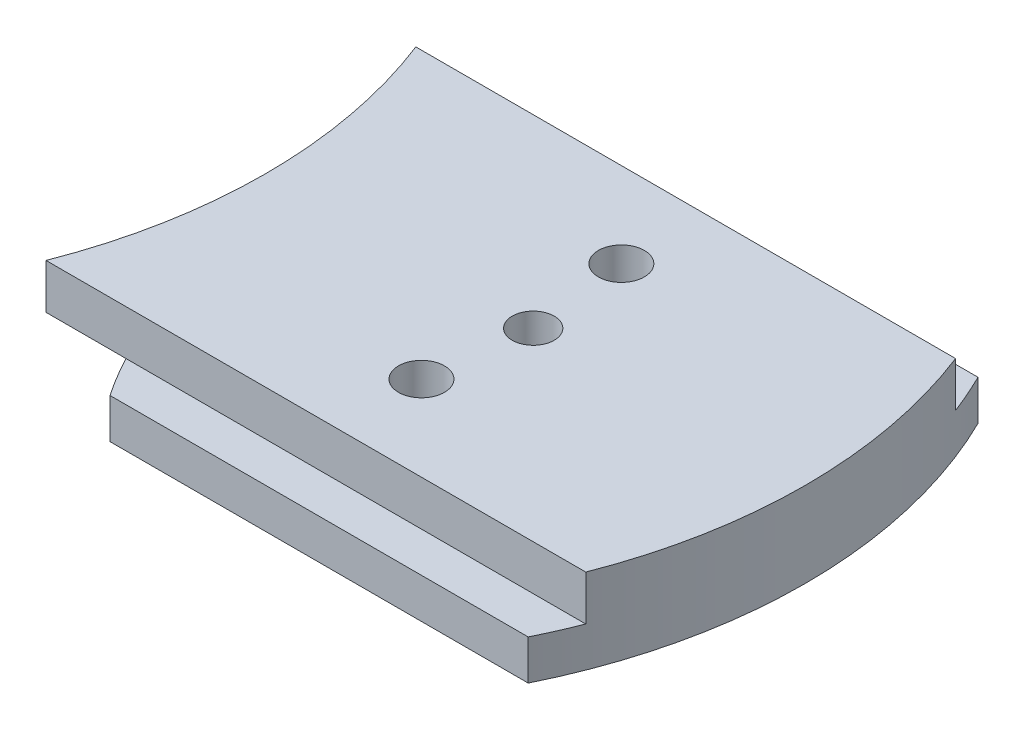
ISO-10303-21;
HEADER;
FILE_DESCRIPTION(('STEP AP214'),'2;1');
FILE_NAME('part.step','',(''),(''),'','','');
FILE_SCHEMA(('AUTOMOTIVE_DESIGN { 1 0 10303 214 1 1 1 1 }'));
ENDSEC;
DATA;
#1=APPLICATION_CONTEXT('core data for automotive mechanical design processes');
#2=APPLICATION_PROTOCOL_DEFINITION('international standard','automotive_design',2000,#1);
#3=PRODUCT_CONTEXT('',#1,'mechanical');
#4=PRODUCT('Part','Part','',(#3));
#5=PRODUCT_RELATED_PRODUCT_CATEGORY('part','',(#4));
#6=PRODUCT_DEFINITION_FORMATION('','',#4);
#7=PRODUCT_DEFINITION_CONTEXT('part definition',#1,'design');
#8=PRODUCT_DEFINITION('design','',#6,#7);
#9=PRODUCT_DEFINITION_SHAPE('','',#8);
#10=(LENGTH_UNIT() NAMED_UNIT(*) SI_UNIT(.MILLI.,.METRE.));
#11=(NAMED_UNIT(*) PLANE_ANGLE_UNIT() SI_UNIT($,.RADIAN.));
#12=(NAMED_UNIT(*) SI_UNIT($,.STERADIAN.) SOLID_ANGLE_UNIT());
#13=UNCERTAINTY_MEASURE_WITH_UNIT(LENGTH_MEASURE(1.E-05),#10,'distance_accuracy_value','');
#14=(GEOMETRIC_REPRESENTATION_CONTEXT(3) GLOBAL_UNCERTAINTY_ASSIGNED_CONTEXT((#13)) GLOBAL_UNIT_ASSIGNED_CONTEXT((#10,
#11,#12)) REPRESENTATION_CONTEXT('',''));
#15=CARTESIAN_POINT('',(0.,0.,0.));
#16=DIRECTION('',(0.,0.,1.));
#17=DIRECTION('',(1.,0.,0.));
#18=AXIS2_PLACEMENT_3D('',#15,#16,#17);
#19=CARTESIAN_POINT('',(0.,2.,0.));
#20=DIRECTION('',(0.,1.,0.));
#21=DIRECTION('',(0.,0.,1.));
#22=AXIS2_PLACEMENT_3D('',#19,#20,#21);
#23=PLANE('',#22);
#24=CARTESIAN_POINT('',(22.6157805464115,2.,-11.25));
#25=DIRECTION('',(0.,1.,0.));
#26=DIRECTION('',(0.,0.,1.));
#27=AXIS2_PLACEMENT_3D('',#24,#25,#26);
#28=CIRCLE('',#27,20.);
#29=CARTESIAN_POINT('',(4.88339492010612,2.,-2.));
#30=VERTEX_POINT('',#29);
#31=CARTESIAN_POINT('',(6.07983485225777,2.,0.));
#32=VERTEX_POINT('',#31);
#33=EDGE_CURVE('E145',#30,#32,#28,.T.);
#34=ORIENTED_EDGE('',*,*,#33,.T.);
#35=DIRECTION('',(1.,0.,0.));
#36=VECTOR('',#35,1.);
#37=CARTESIAN_POINT('',(0.,2.,0.));
#38=LINE('',#37,#36);
#39=CARTESIAN_POINT('',(27.,2.,0.));
#40=VERTEX_POINT('',#39);
#41=EDGE_CURVE('E68',#32,#40,#38,.T.);
#42=ORIENTED_EDGE('',*,*,#41,.T.);
#43=CARTESIAN_POINT('',(4.11578054641147,2.,-11.25));
#44=DIRECTION('',(0.,1.,0.));
#45=DIRECTION('',(0.,0.,1.));
#46=AXIS2_PLACEMENT_3D('',#43,#44,#45);
#47=CIRCLE('',#46,25.5);
#48=CARTESIAN_POINT('',(27.87893479832,2.,-2.));
#49=VERTEX_POINT('',#48);
#50=EDGE_CURVE('E178',#49,#40,#47,.F.);
#51=ORIENTED_EDGE('',*,*,#50,.F.);
#52=DIRECTION('',(-1.,0.,0.));
#53=VECTOR('',#52,1.);
#54=CARTESIAN_POINT('',(0.,2.,-2.));
#55=LINE('',#54,#53);
#56=EDGE_CURVE('E155',#49,#30,#55,.T.);
#57=ORIENTED_EDGE('',*,*,#56,.T.);
#58=EDGE_LOOP('',(#34,#42,#51,#57));
#59=FACE_BOUND('',#58,.T.);
#60=ADVANCED_FACE('F51',(#59),#23,.T.);
#61=CARTESIAN_POINT('',(4.11578054641147,2.,-11.25));
#62=DIRECTION('',(0.,-1.,0.));
#63=DIRECTION('',(0.,0.,-1.));
#64=AXIS2_PLACEMENT_3D('',#61,#62,#63);
#65=CYLINDRICAL_SURFACE('',#64,25.5);
#66=CARTESIAN_POINT('',(4.11578054641147,0.,-11.25));
#67=DIRECTION('',(0.,1.,0.));
#68=DIRECTION('',(0.,0.,1.));
#69=AXIS2_PLACEMENT_3D('',#66,#67,#68);
#70=CIRCLE('',#69,25.5);
#71=CARTESIAN_POINT('',(27.,0.,-22.5));
#72=VERTEX_POINT('',#71);
#73=CARTESIAN_POINT('',(27.,0.,0.));
#74=VERTEX_POINT('',#73);
#75=EDGE_CURVE('E171',#72,#74,#70,.F.);
#76=ORIENTED_EDGE('',*,*,#75,.F.);
#77=DIRECTION('',(0.,-1.,0.));
#78=VECTOR('',#77,1.);
#79=CARTESIAN_POINT('',(27.,2.,-22.5));
#80=LINE('',#79,#78);
#81=CARTESIAN_POINT('',(27.,2.,-22.5));
#82=VERTEX_POINT('',#81);
#83=EDGE_CURVE('E165',#82,#72,#80,.T.);
#84=ORIENTED_EDGE('',*,*,#83,.F.);
#85=CARTESIAN_POINT('',(27.87893479832,2.,-20.5));
#86=VERTEX_POINT('',#85);
#87=EDGE_CURVE('E167',#82,#86,#47,.F.);
#88=ORIENTED_EDGE('',*,*,#87,.T.);
#89=DIRECTION('',(0.,-1.,0.));
#90=VECTOR('',#89,1.);
#91=CARTESIAN_POINT('',(27.87893479832,4.25,-20.5));
#92=LINE('',#91,#90);
#93=CARTESIAN_POINT('',(27.87893479832,4.25,-20.5));
#94=VERTEX_POINT('',#93);
#95=EDGE_CURVE('E239',#94,#86,#92,.T.);
#96=ORIENTED_EDGE('',*,*,#95,.F.);
#97=CARTESIAN_POINT('',(4.11578054641147,4.25,-11.25));
#98=DIRECTION('',(0.,1.,0.));
#99=DIRECTION('',(0.,0.,1.));
#100=AXIS2_PLACEMENT_3D('',#97,#98,#99);
#101=CIRCLE('',#100,25.5);
#102=CARTESIAN_POINT('',(27.87893479832,4.25,-2.));
#103=VERTEX_POINT('',#102);
#104=EDGE_CURVE('E229',#103,#94,#101,.T.);
#105=ORIENTED_EDGE('',*,*,#104,.F.);
#106=DIRECTION('',(0.,-1.,0.));
#107=VECTOR('',#106,1.);
#108=CARTESIAN_POINT('',(27.87893479832,4.25,-2.));
#109=LINE('',#108,#107);
#110=EDGE_CURVE('E108',#103,#49,#109,.T.);
#111=ORIENTED_EDGE('',*,*,#110,.T.);
#112=ORIENTED_EDGE('',*,*,#50,.T.);
#113=DIRECTION('',(0.,-1.,0.));
#114=VECTOR('',#113,1.);
#115=CARTESIAN_POINT('',(27.,2.,0.));
#116=LINE('',#115,#114);
#117=EDGE_CURVE('E162',#40,#74,#116,.T.);
#118=ORIENTED_EDGE('',*,*,#117,.T.);
#119=EDGE_LOOP('',(#76,#84,#88,#96,#105,#111,#112,#118));
#120=FACE_BOUND('',#119,.T.);
#121=ADVANCED_FACE('F247',(#120),#65,.T.);
#122=CARTESIAN_POINT('',(0.,2.,-22.5));
#123=DIRECTION('',(0.,0.,-1.));
#124=DIRECTION('',(-1.,0.,0.));
#125=AXIS2_PLACEMENT_3D('',#122,#123,#124);
#126=PLANE('',#125);
#127=DIRECTION('',(0.,-1.,0.));
#128=VECTOR('',#127,1.);
#129=CARTESIAN_POINT('',(6.07983485225777,25.0932752413132,-22.5));
#130=LINE('',#129,#128);
#131=CARTESIAN_POINT('',(6.07983485225777,2.,-22.5));
#132=VERTEX_POINT('',#131);
#133=CARTESIAN_POINT('',(6.07983485225777,0.,-22.5));
#134=VERTEX_POINT('',#133);
#135=EDGE_CURVE('E151',#132,#134,#130,.T.);
#136=ORIENTED_EDGE('',*,*,#135,.F.);
#137=DIRECTION('',(1.,0.,0.));
#138=VECTOR('',#137,1.);
#139=CARTESIAN_POINT('',(0.,2.,-22.5));
#140=LINE('',#139,#138);
#141=EDGE_CURVE('E163',#132,#82,#140,.T.);
#142=ORIENTED_EDGE('',*,*,#141,.T.);
#143=ORIENTED_EDGE('',*,*,#83,.T.);
#144=DIRECTION('',(1.,0.,0.));
#145=VECTOR('',#144,1.);
#146=CARTESIAN_POINT('',(0.,0.,-22.5));
#147=LINE('',#146,#145);
#148=EDGE_CURVE('E80',#134,#72,#147,.T.);
#149=ORIENTED_EDGE('',*,*,#148,.F.);
#150=EDGE_LOOP('',(#136,#142,#143,#149));
#151=FACE_BOUND('',#150,.T.);
#152=ADVANCED_FACE('F296',(#151),#126,.T.);
#153=CARTESIAN_POINT('',(-22.8842194535885,2.,-11.25));
#154=DIRECTION('',(0.,-1.,0.));
#155=DIRECTION('',(0.,0.,-1.));
#156=AXIS2_PLACEMENT_3D('',#153,#154,#155);
#157=CYLINDRICAL_SURFACE('',#156,25.5);
#158=DIRECTION('',(0.,-1.,0.));
#159=VECTOR('',#158,1.);
#160=CARTESIAN_POINT('',(0.878934798320023,4.25,-20.5));
#161=LINE('',#160,#159);
#162=CARTESIAN_POINT('',(0.878934798320023,4.25,-20.5));
#163=VERTEX_POINT('',#162);
#164=CARTESIAN_POINT('',(0.878934798320023,2.,-20.5));
#165=VERTEX_POINT('',#164);
#166=EDGE_CURVE('E233',#163,#165,#161,.T.);
#167=ORIENTED_EDGE('',*,*,#166,.T.);
#168=CARTESIAN_POINT('',(-22.8842194535885,2.,-11.25));
#169=DIRECTION('',(0.,1.,0.));
#170=DIRECTION('',(0.,0.,1.));
#171=AXIS2_PLACEMENT_3D('',#168,#169,#170);
#172=CIRCLE('',#171,25.5);
#173=CARTESIAN_POINT('',(2.61578054641146,2.,-11.25));
#174=VERTEX_POINT('',#173);
#175=EDGE_CURVE('E263',#165,#174,#172,.F.);
#176=ORIENTED_EDGE('',*,*,#175,.T.);
#177=CARTESIAN_POINT('',(0.878934798320026,2.,-2.));
#178=VERTEX_POINT('',#177);
#179=EDGE_CURVE('E222',#174,#178,#172,.F.);
#180=ORIENTED_EDGE('',*,*,#179,.T.);
#181=DIRECTION('',(0.,-1.,0.));
#182=VECTOR('',#181,1.);
#183=CARTESIAN_POINT('',(0.878934798320026,4.25,-2.));
#184=LINE('',#183,#182);
#185=CARTESIAN_POINT('',(0.878934798320026,4.25,-2.));
#186=VERTEX_POINT('',#185);
#187=EDGE_CURVE('E90',#186,#178,#184,.T.);
#188=ORIENTED_EDGE('',*,*,#187,.F.);
#189=CARTESIAN_POINT('',(-22.8842194535885,4.25,-11.25));
#190=DIRECTION('',(0.,1.,0.));
#191=DIRECTION('',(0.,0.,1.));
#192=AXIS2_PLACEMENT_3D('',#189,#190,#191);
#193=CIRCLE('',#192,25.5);
#194=EDGE_CURVE('E226',#186,#163,#193,.T.);
#195=ORIENTED_EDGE('',*,*,#194,.T.);
#196=EDGE_LOOP('',(#167,#176,#180,#188,#195));
#197=FACE_BOUND('',#196,.T.);
#198=ADVANCED_FACE('F262',(#197),#157,.F.);
#199=CARTESIAN_POINT('',(0.,2.,0.));
#200=DIRECTION('',(0.,0.,-1.));
#201=DIRECTION('',(-1.,0.,0.));
#202=AXIS2_PLACEMENT_3D('',#199,#200,#201);
#203=PLANE('',#202);
#204=ORIENTED_EDGE('',*,*,#41,.F.);
#205=DIRECTION('',(0.,-1.,0.));
#206=VECTOR('',#205,1.);
#207=CARTESIAN_POINT('',(6.07983485225777,25.0932752413132,0.));
#208=LINE('',#207,#206);
#209=CARTESIAN_POINT('',(6.07983485225777,0.,0.));
#210=VERTEX_POINT('',#209);
#211=EDGE_CURVE('E141',#32,#210,#208,.T.);
#212=ORIENTED_EDGE('',*,*,#211,.T.);
#213=DIRECTION('',(1.,0.,0.));
#214=VECTOR('',#213,1.);
#215=CARTESIAN_POINT('',(0.,0.,0.));
#216=LINE('',#215,#214);
#217=EDGE_CURVE('E174',#210,#74,#216,.T.);
#218=ORIENTED_EDGE('',*,*,#217,.T.);
#219=ORIENTED_EDGE('',*,*,#117,.F.);
#220=EDGE_LOOP('',(#204,#212,#218,#219));
#221=FACE_BOUND('',#220,.T.);
#222=ADVANCED_FACE('F160',(#221),#203,.F.);
#223=CARTESIAN_POINT('',(16.,2.,-11.25));
#224=DIRECTION('',(0.,-1.,0.));
#225=DIRECTION('',(0.,0.,-1.));
#226=AXIS2_PLACEMENT_3D('',#223,#224,#225);
#227=CYLINDRICAL_SURFACE('',#226,1.05);
#228=CARTESIAN_POINT('',(16.,0.,-11.25));
#229=DIRECTION('',(0.,1.,0.));
#230=DIRECTION('',(0.,0.,1.));
#231=AXIS2_PLACEMENT_3D('',#228,#229,#230);
#232=CIRCLE('',#231,1.05);
#233=CARTESIAN_POINT('',(16.,0.,-10.2));
#234=VERTEX_POINT('',#233);
#235=EDGE_CURVE('E176',#234,#234,#232,.T.);
#236=ORIENTED_EDGE('',*,*,#235,.F.);
#237=EDGE_LOOP('',(#236));
#238=FACE_BOUND('',#237,.T.);
#239=CARTESIAN_POINT('',(16.,4.25,-11.25));
#240=DIRECTION('',(0.,1.,0.));
#241=DIRECTION('',(0.,0.,1.));
#242=AXIS2_PLACEMENT_3D('',#239,#240,#241);
#243=CIRCLE('',#242,1.05);
#244=CARTESIAN_POINT('',(16.,4.25,-10.2));
#245=VERTEX_POINT('',#244);
#246=EDGE_CURVE('E214',#245,#245,#243,.T.);
#247=ORIENTED_EDGE('',*,*,#246,.T.);
#248=EDGE_LOOP('',(#247));
#249=FACE_BOUND('',#248,.T.);
#250=ADVANCED_FACE('F208',(#238,#249),#227,.F.);
#251=CARTESIAN_POINT('',(4.88339492010613,2.,-20.5));
#252=VERTEX_POINT('',#251);
#253=EDGE_CURVE('E152',#132,#252,#28,.T.);
#254=ORIENTED_EDGE('',*,*,#253,.T.);
#255=DIRECTION('',(-1.,0.,0.));
#256=VECTOR('',#255,1.);
#257=CARTESIAN_POINT('',(0.,2.,-20.5));
#258=LINE('',#257,#256);
#259=EDGE_CURVE('E220',#86,#252,#258,.T.);
#260=ORIENTED_EDGE('',*,*,#259,.F.);
#261=ORIENTED_EDGE('',*,*,#87,.F.);
#262=ORIENTED_EDGE('',*,*,#141,.F.);
#263=EDGE_LOOP('',(#254,#260,#261,#262));
#264=FACE_BOUND('',#263,.T.);
#265=ADVANCED_FACE('F202',(#264),#23,.T.);
#266=CARTESIAN_POINT('',(0.,0.,0.));
#267=DIRECTION('',(0.,1.,0.));
#268=DIRECTION('',(0.,0.,1.));
#269=AXIS2_PLACEMENT_3D('',#266,#267,#268);
#270=PLANE('',#269);
#271=CARTESIAN_POINT('',(15.4105236663265,0.,-16.25));
#272=DIRECTION('',(0.,1.,0.));
#273=DIRECTION('',(0.,0.,1.));
#274=AXIS2_PLACEMENT_3D('',#271,#272,#273);
#275=CIRCLE('',#274,2.34999999999999);
#276=CARTESIAN_POINT('',(15.4105236663265,0.,-13.9));
#277=VERTEX_POINT('',#276);
#278=EDGE_CURVE('E185',#277,#277,#275,.T.);
#279=ORIENTED_EDGE('',*,*,#278,.T.);
#280=EDGE_LOOP('',(#279));
#281=FACE_BOUND('',#280,.T.);
#282=CARTESIAN_POINT('',(15.4105236663265,0.,-6.25));
#283=DIRECTION('',(0.,1.,0.));
#284=DIRECTION('',(0.,0.,1.));
#285=AXIS2_PLACEMENT_3D('',#282,#283,#284);
#286=CIRCLE('',#285,2.35);
#287=CARTESIAN_POINT('',(15.4105236663265,0.,-3.9));
#288=VERTEX_POINT('',#287);
#289=EDGE_CURVE('E182',#288,#288,#286,.T.);
#290=ORIENTED_EDGE('',*,*,#289,.T.);
#291=EDGE_LOOP('',(#290));
#292=FACE_BOUND('',#291,.T.);
#293=ORIENTED_EDGE('',*,*,#217,.F.);
#294=CARTESIAN_POINT('',(22.6157805464115,0.,-11.25));
#295=DIRECTION('',(0.,1.,0.));
#296=DIRECTION('',(0.,0.,1.));
#297=AXIS2_PLACEMENT_3D('',#294,#295,#296);
#298=CIRCLE('',#297,20.);
#299=EDGE_CURVE('E148',#210,#134,#298,.F.);
#300=ORIENTED_EDGE('',*,*,#299,.T.);
#301=ORIENTED_EDGE('',*,*,#148,.T.);
#302=ORIENTED_EDGE('',*,*,#75,.T.);
#303=EDGE_LOOP('',(#293,#300,#301,#302));
#304=FACE_BOUND('',#303,.T.);
#305=ORIENTED_EDGE('',*,*,#235,.T.);
#306=EDGE_LOOP('',(#305));
#307=FACE_BOUND('',#306,.T.);
#308=ADVANCED_FACE('F198',(#281,#292,#304,#307),#270,.F.);
#309=CARTESIAN_POINT('',(-22.8842194535885,4.25,-11.25));
#310=DIRECTION('',(0.,1.,0.));
#311=DIRECTION('',(0.,0.,1.));
#312=AXIS2_PLACEMENT_3D('',#309,#310,#311);
#313=PLANE('',#312);
#314=CARTESIAN_POINT('',(15.4105236663265,4.25,-16.25));
#315=DIRECTION('',(0.,1.,0.));
#316=DIRECTION('',(0.,0.,1.));
#317=AXIS2_PLACEMENT_3D('',#314,#315,#316);
#318=CIRCLE('',#317,1.15);
#319=CARTESIAN_POINT('',(15.4105236663265,4.25,-15.1));
#320=VERTEX_POINT('',#319);
#321=EDGE_CURVE('E157',#320,#320,#318,.T.);
#322=ORIENTED_EDGE('',*,*,#321,.F.);
#323=EDGE_LOOP('',(#322));
#324=FACE_BOUND('',#323,.T.);
#325=CARTESIAN_POINT('',(15.4105236663265,4.25,-6.25));
#326=DIRECTION('',(0.,1.,0.));
#327=DIRECTION('',(0.,0.,1.));
#328=AXIS2_PLACEMENT_3D('',#325,#326,#327);
#329=CIRCLE('',#328,1.15);
#330=CARTESIAN_POINT('',(15.4105236663265,4.25,-5.1));
#331=VERTEX_POINT('',#330);
#332=EDGE_CURVE('E267',#331,#331,#329,.T.);
#333=ORIENTED_EDGE('',*,*,#332,.F.);
#334=EDGE_LOOP('',(#333));
#335=FACE_BOUND('',#334,.T.);
#336=ORIENTED_EDGE('',*,*,#194,.F.);
#337=DIRECTION('',(-1.,0.,0.));
#338=VECTOR('',#337,1.);
#339=CARTESIAN_POINT('',(0.,4.25,-2.));
#340=LINE('',#339,#338);
#341=EDGE_CURVE('E231',#103,#186,#340,.T.);
#342=ORIENTED_EDGE('',*,*,#341,.F.);
#343=ORIENTED_EDGE('',*,*,#104,.T.);
#344=DIRECTION('',(-1.,0.,0.));
#345=VECTOR('',#344,1.);
#346=CARTESIAN_POINT('',(0.,4.25,-20.5));
#347=LINE('',#346,#345);
#348=EDGE_CURVE('E115',#94,#163,#347,.T.);
#349=ORIENTED_EDGE('',*,*,#348,.T.);
#350=EDGE_LOOP('',(#336,#342,#343,#349));
#351=FACE_BOUND('',#350,.T.);
#352=ORIENTED_EDGE('',*,*,#246,.F.);
#353=EDGE_LOOP('',(#352));
#354=FACE_BOUND('',#353,.T.);
#355=ADVANCED_FACE('F201',(#324,#335,#351,#354),#313,.T.);
#356=CARTESIAN_POINT('',(0.,4.25,-2.));
#357=DIRECTION('',(0.,0.,1.));
#358=DIRECTION('',(1.,0.,0.));
#359=AXIS2_PLACEMENT_3D('',#356,#357,#358);
#360=PLANE('',#359);
#361=ORIENTED_EDGE('',*,*,#56,.F.);
#362=ORIENTED_EDGE('',*,*,#110,.F.);
#363=ORIENTED_EDGE('',*,*,#341,.T.);
#364=ORIENTED_EDGE('',*,*,#187,.T.);
#365=DIRECTION('',(-1.,0.,0.));
#366=VECTOR('',#365,1.);
#367=CARTESIAN_POINT('',(0.,2.,-2.));
#368=LINE('',#367,#366);
#369=EDGE_CURVE('E217',#30,#178,#368,.T.);
#370=ORIENTED_EDGE('',*,*,#369,.F.);
#371=EDGE_LOOP('',(#361,#362,#363,#364,#370));
#372=FACE_BOUND('',#371,.T.);
#373=ADVANCED_FACE('F257',(#372),#360,.T.);
#374=CARTESIAN_POINT('',(0.,4.25,-20.5));
#375=DIRECTION('',(0.,0.,1.));
#376=DIRECTION('',(1.,0.,0.));
#377=AXIS2_PLACEMENT_3D('',#374,#375,#376);
#378=PLANE('',#377);
#379=ORIENTED_EDGE('',*,*,#259,.T.);
#380=EDGE_CURVE('E216',#252,#165,#258,.T.);
#381=ORIENTED_EDGE('',*,*,#380,.T.);
#382=ORIENTED_EDGE('',*,*,#166,.F.);
#383=ORIENTED_EDGE('',*,*,#348,.F.);
#384=ORIENTED_EDGE('',*,*,#95,.T.);
#385=EDGE_LOOP('',(#379,#381,#382,#383,#384));
#386=FACE_BOUND('',#385,.T.);
#387=ADVANCED_FACE('F254',(#386),#378,.F.);
#388=CARTESIAN_POINT('',(22.6157805464115,25.0932752413132,-11.25));
#389=DIRECTION('',(0.,-1.,0.));
#390=DIRECTION('',(0.,0.,-1.));
#391=AXIS2_PLACEMENT_3D('',#388,#389,#390);
#392=CYLINDRICAL_SURFACE('',#391,20.);
#393=EDGE_CURVE('E266',#252,#174,#28,.T.);
#394=ORIENTED_EDGE('',*,*,#393,.F.);
#395=ORIENTED_EDGE('',*,*,#253,.F.);
#396=ORIENTED_EDGE('',*,*,#135,.T.);
#397=ORIENTED_EDGE('',*,*,#299,.F.);
#398=ORIENTED_EDGE('',*,*,#211,.F.);
#399=ORIENTED_EDGE('',*,*,#33,.F.);
#400=EDGE_CURVE('E156',#174,#30,#28,.T.);
#401=ORIENTED_EDGE('',*,*,#400,.F.);
#402=EDGE_LOOP('',(#394,#395,#396,#397,#398,#399,#401));
#403=FACE_BOUND('',#402,.T.);
#404=ADVANCED_FACE('F143',(#403),#392,.T.);
#405=CARTESIAN_POINT('',(0.,2.,0.));
#406=DIRECTION('',(0.,1.,0.));
#407=DIRECTION('',(0.,0.,1.));
#408=AXIS2_PLACEMENT_3D('',#405,#406,#407);
#409=PLANE('',#408);
#410=ORIENTED_EDGE('',*,*,#369,.T.);
#411=ORIENTED_EDGE('',*,*,#179,.F.);
#412=ORIENTED_EDGE('',*,*,#400,.T.);
#413=EDGE_LOOP('',(#410,#411,#412));
#414=FACE_BOUND('',#413,.T.);
#415=ADVANCED_FACE('F260',(#414),#409,.F.);
#416=ORIENTED_EDGE('',*,*,#380,.F.);
#417=ORIENTED_EDGE('',*,*,#393,.T.);
#418=ORIENTED_EDGE('',*,*,#175,.F.);
#419=EDGE_LOOP('',(#416,#417,#418));
#420=FACE_BOUND('',#419,.T.);
#421=ADVANCED_FACE('F280',(#420),#409,.F.);
#422=CARTESIAN_POINT('',(15.4105236663265,0.,-6.25));
#423=DIRECTION('',(0.,1.,0.));
#424=DIRECTION('',(0.,0.,1.));
#425=AXIS2_PLACEMENT_3D('',#422,#423,#424);
#426=CYLINDRICAL_SURFACE('',#425,1.15);
#427=CARTESIAN_POINT('',(15.4105236663265,1.2,-6.25));
#428=DIRECTION('',(0.,1.,0.));
#429=DIRECTION('',(0.,0.,1.));
#430=AXIS2_PLACEMENT_3D('',#427,#428,#429);
#431=CIRCLE('',#430,1.15);
#432=CARTESIAN_POINT('',(15.4105236663265,1.2,-5.1));
#433=VERTEX_POINT('',#432);
#434=EDGE_CURVE('E12',#433,#433,#431,.F.);
#435=ORIENTED_EDGE('',*,*,#434,.T.);
#436=EDGE_LOOP('',(#435));
#437=FACE_BOUND('',#436,.T.);
#438=ORIENTED_EDGE('',*,*,#332,.T.);
#439=EDGE_LOOP('',(#438));
#440=FACE_BOUND('',#439,.T.);
#441=ADVANCED_FACE('F278',(#437,#440),#426,.F.);
#442=CARTESIAN_POINT('',(15.4105236663265,0.,-16.25));
#443=DIRECTION('',(0.,1.,0.));
#444=DIRECTION('',(0.,0.,1.));
#445=AXIS2_PLACEMENT_3D('',#442,#443,#444);
#446=CYLINDRICAL_SURFACE('',#445,1.15);
#447=CARTESIAN_POINT('',(15.4105236663265,1.2,-16.25));
#448=DIRECTION('',(0.,1.,0.));
#449=DIRECTION('',(0.,0.,1.));
#450=AXIS2_PLACEMENT_3D('',#447,#448,#449);
#451=CIRCLE('',#450,1.15);
#452=CARTESIAN_POINT('',(15.4105236663265,1.2,-15.1));
#453=VERTEX_POINT('',#452);
#454=EDGE_CURVE('E60',#453,#453,#451,.F.);
#455=ORIENTED_EDGE('',*,*,#454,.T.);
#456=EDGE_LOOP('',(#455));
#457=FACE_BOUND('',#456,.T.);
#458=ORIENTED_EDGE('',*,*,#321,.T.);
#459=EDGE_LOOP('',(#458));
#460=FACE_BOUND('',#459,.T.);
#461=ADVANCED_FACE('F190',(#457,#460),#446,.F.);
#462=CARTESIAN_POINT('',(15.4105236663265,0.,-16.25));
#463=DIRECTION('',(0.,-1.,0.));
#464=DIRECTION('',(0.,0.,-1.));
#465=AXIS2_PLACEMENT_3D('',#462,#463,#464);
#466=CONICAL_SURFACE('',#465,2.34999999999999,0.785398163397444);
#467=ORIENTED_EDGE('',*,*,#454,.F.);
#468=EDGE_LOOP('',(#467));
#469=FACE_BOUND('',#468,.T.);
#470=ORIENTED_EDGE('',*,*,#278,.F.);
#471=EDGE_LOOP('',(#470));
#472=FACE_BOUND('',#471,.T.);
#473=ADVANCED_FACE('F193',(#469,#472),#466,.F.);
#474=CARTESIAN_POINT('',(15.4105236663265,0.,-6.25));
#475=DIRECTION('',(0.,-1.,0.));
#476=DIRECTION('',(0.,0.,-1.));
#477=AXIS2_PLACEMENT_3D('',#474,#475,#476);
#478=CONICAL_SURFACE('',#477,2.35,0.785398163397444);
#479=ORIENTED_EDGE('',*,*,#434,.F.);
#480=EDGE_LOOP('',(#479));
#481=FACE_BOUND('',#480,.T.);
#482=ORIENTED_EDGE('',*,*,#289,.F.);
#483=EDGE_LOOP('',(#482));
#484=FACE_BOUND('',#483,.T.);
#485=ADVANCED_FACE('F53',(#481,#484),#478,.F.);
#486=CLOSED_SHELL('',(#60,#121,#152,#198,#222,#250,#265,#308,#355,#373,#387,#404,#415,#421,#441,
#461,#473,#485));
#487=MANIFOLD_SOLID_BREP('B2',#486);
#488=ADVANCED_BREP_SHAPE_REPRESENTATION('',(#18,#487),#14);
#489=SHAPE_DEFINITION_REPRESENTATION(#9,#488);
ENDSEC;
END-ISO-10303-21;
